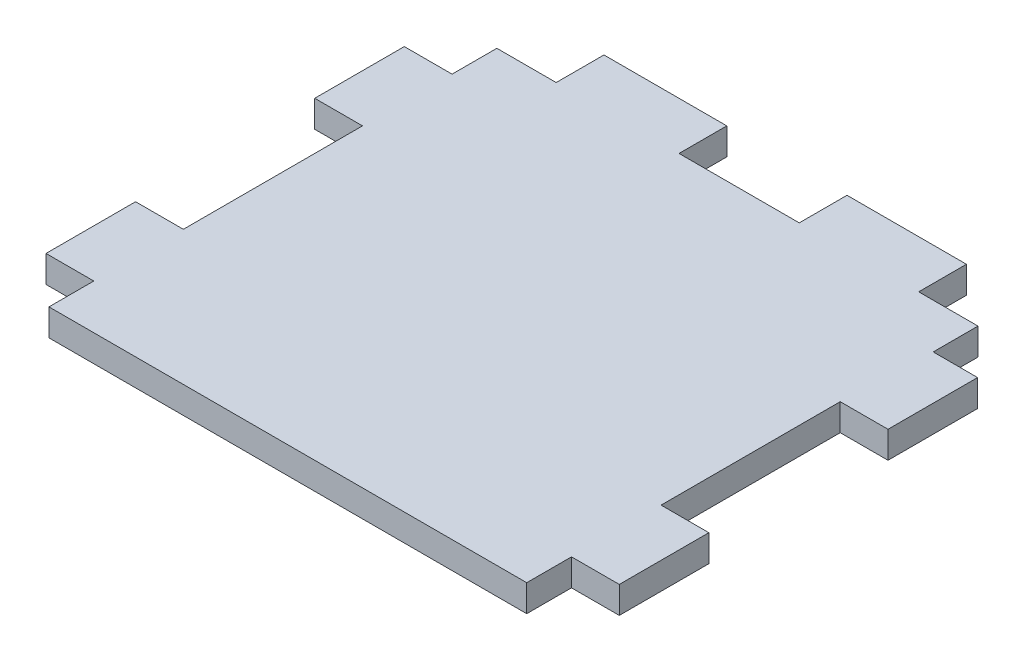
ISO-10303-21;
HEADER;
FILE_DESCRIPTION(('STEP AP214'),'2;1');
FILE_NAME('part.step','',(''),(''),'','','');
FILE_SCHEMA(('AUTOMOTIVE_DESIGN { 1 0 10303 214 1 1 1 1 }'));
ENDSEC;
DATA;
#1=APPLICATION_CONTEXT('core data for automotive mechanical design processes');
#2=APPLICATION_PROTOCOL_DEFINITION('international standard','automotive_design',2000,#1);
#3=PRODUCT_CONTEXT('',#1,'mechanical');
#4=PRODUCT('Part','Part','',(#3));
#5=PRODUCT_RELATED_PRODUCT_CATEGORY('part','',(#4));
#6=PRODUCT_DEFINITION_FORMATION('','',#4);
#7=PRODUCT_DEFINITION_CONTEXT('part definition',#1,'design');
#8=PRODUCT_DEFINITION('design','',#6,#7);
#9=PRODUCT_DEFINITION_SHAPE('','',#8);
#10=(LENGTH_UNIT() NAMED_UNIT(*) SI_UNIT(.MILLI.,.METRE.));
#11=(NAMED_UNIT(*) PLANE_ANGLE_UNIT() SI_UNIT($,.RADIAN.));
#12=(NAMED_UNIT(*) SI_UNIT($,.STERADIAN.) SOLID_ANGLE_UNIT());
#13=UNCERTAINTY_MEASURE_WITH_UNIT(LENGTH_MEASURE(1.E-05),#10,'distance_accuracy_value','');
#14=(GEOMETRIC_REPRESENTATION_CONTEXT(3) GLOBAL_UNCERTAINTY_ASSIGNED_CONTEXT((#13)) GLOBAL_UNIT_ASSIGNED_CONTEXT((#10,
#11,#12)) REPRESENTATION_CONTEXT('',''));
#15=CARTESIAN_POINT('',(0.,0.,0.));
#16=DIRECTION('',(0.,0.,1.));
#17=DIRECTION('',(1.,0.,0.));
#18=AXIS2_PLACEMENT_3D('',#15,#16,#17);
#19=CARTESIAN_POINT('',(40.,-4.5,0.));
#20=DIRECTION('',(-1.,0.,0.));
#21=DIRECTION('',(0.,0.,1.));
#22=AXIS2_PLACEMENT_3D('',#19,#20,#21);
#23=PLANE('',#22);
#24=DIRECTION('',(0.,0.,1.));
#25=VECTOR('',#24,1.);
#26=CARTESIAN_POINT('',(40.,0.,0.));
#27=LINE('',#26,#25);
#28=CARTESIAN_POINT('',(40.,0.,30.));
#29=VERTEX_POINT('',#28);
#30=CARTESIAN_POINT('',(40.,0.,37.5));
#31=VERTEX_POINT('',#30);
#32=EDGE_CURVE('E252',#29,#31,#27,.T.);
#33=ORIENTED_EDGE('',*,*,#32,.T.);
#34=DIRECTION('',(0.,1.,0.));
#35=VECTOR('',#34,1.);
#36=CARTESIAN_POINT('',(40.,-4.5,37.5));
#37=LINE('',#36,#35);
#38=CARTESIAN_POINT('',(40.,-4.5,37.5));
#39=VERTEX_POINT('',#38);
#40=EDGE_CURVE('E11',#39,#31,#37,.T.);
#41=ORIENTED_EDGE('',*,*,#40,.F.);
#42=DIRECTION('',(0.,0.,1.));
#43=VECTOR('',#42,1.);
#44=CARTESIAN_POINT('',(40.,-4.5,0.));
#45=LINE('',#44,#43);
#46=CARTESIAN_POINT('',(40.,-4.5,30.));
#47=VERTEX_POINT('',#46);
#48=EDGE_CURVE('E53',#47,#39,#45,.T.);
#49=ORIENTED_EDGE('',*,*,#48,.F.);
#50=DIRECTION('',(0.,1.,0.));
#51=VECTOR('',#50,1.);
#52=CARTESIAN_POINT('',(40.,-4.5,30.));
#53=LINE('',#52,#51);
#54=EDGE_CURVE('E38',#47,#29,#53,.T.);
#55=ORIENTED_EDGE('',*,*,#54,.T.);
#56=EDGE_LOOP('',(#33,#41,#49,#55));
#57=FACE_BOUND('',#56,.T.);
#58=ADVANCED_FACE('F35',(#57),#23,.F.);
#59=CARTESIAN_POINT('',(0.,-4.5,37.5));
#60=DIRECTION('',(0.,0.,1.));
#61=DIRECTION('',(1.,0.,0.));
#62=AXIS2_PLACEMENT_3D('',#59,#60,#61);
#63=PLANE('',#62);
#64=DIRECTION('',(1.,0.,0.));
#65=VECTOR('',#64,1.);
#66=CARTESIAN_POINT('',(0.,0.,37.5));
#67=LINE('',#66,#65);
#68=CARTESIAN_POINT('',(-40.,0.,37.5));
#69=VERTEX_POINT('',#68);
#70=EDGE_CURVE('E323',#69,#31,#67,.T.);
#71=ORIENTED_EDGE('',*,*,#70,.F.);
#72=DIRECTION('',(0.,1.,0.));
#73=VECTOR('',#72,1.);
#74=CARTESIAN_POINT('',(-40.,-4.5,37.5));
#75=LINE('',#74,#73);
#76=CARTESIAN_POINT('',(-40.,-4.5,37.5));
#77=VERTEX_POINT('',#76);
#78=EDGE_CURVE('E44',#77,#69,#75,.T.);
#79=ORIENTED_EDGE('',*,*,#78,.F.);
#80=DIRECTION('',(1.,0.,0.));
#81=VECTOR('',#80,1.);
#82=CARTESIAN_POINT('',(0.,-4.5,37.5));
#83=LINE('',#82,#81);
#84=EDGE_CURVE('E242',#77,#39,#83,.T.);
#85=ORIENTED_EDGE('',*,*,#84,.T.);
#86=ORIENTED_EDGE('',*,*,#40,.T.);
#87=EDGE_LOOP('',(#71,#79,#85,#86));
#88=FACE_BOUND('',#87,.T.);
#89=ADVANCED_FACE('F385',(#88),#63,.T.);
#90=CARTESIAN_POINT('',(-40.,-4.5,0.));
#91=DIRECTION('',(-1.,0.,0.));
#92=DIRECTION('',(0.,0.,1.));
#93=AXIS2_PLACEMENT_3D('',#90,#91,#92);
#94=PLANE('',#93);
#95=DIRECTION('',(0.,0.,1.));
#96=VECTOR('',#95,1.);
#97=CARTESIAN_POINT('',(-40.,0.,0.));
#98=LINE('',#97,#96);
#99=CARTESIAN_POINT('',(-40.,0.,30.));
#100=VERTEX_POINT('',#99);
#101=EDGE_CURVE('E230',#100,#69,#98,.T.);
#102=ORIENTED_EDGE('',*,*,#101,.F.);
#103=DIRECTION('',(0.,1.,0.));
#104=VECTOR('',#103,1.);
#105=CARTESIAN_POINT('',(-40.,-4.5,30.));
#106=LINE('',#105,#104);
#107=CARTESIAN_POINT('',(-40.,-4.5,30.));
#108=VERTEX_POINT('',#107);
#109=EDGE_CURVE('E226',#108,#100,#106,.T.);
#110=ORIENTED_EDGE('',*,*,#109,.F.);
#111=DIRECTION('',(0.,0.,1.));
#112=VECTOR('',#111,1.);
#113=CARTESIAN_POINT('',(-40.,-4.5,0.));
#114=LINE('',#113,#112);
#115=EDGE_CURVE('E229',#108,#77,#114,.T.);
#116=ORIENTED_EDGE('',*,*,#115,.T.);
#117=ORIENTED_EDGE('',*,*,#78,.T.);
#118=EDGE_LOOP('',(#102,#110,#116,#117));
#119=FACE_BOUND('',#118,.T.);
#120=ADVANCED_FACE('F228',(#119),#94,.T.);
#121=CARTESIAN_POINT('',(0.,-4.5,30.));
#122=DIRECTION('',(0.,0.,1.));
#123=DIRECTION('',(1.,0.,0.));
#124=AXIS2_PLACEMENT_3D('',#121,#122,#123);
#125=PLANE('',#124);
#126=DIRECTION('',(1.,0.,0.));
#127=VECTOR('',#126,1.);
#128=CARTESIAN_POINT('',(0.,0.,30.));
#129=LINE('',#128,#127);
#130=CARTESIAN_POINT('',(-48.,0.,30.));
#131=VERTEX_POINT('',#130);
#132=EDGE_CURVE('E320',#131,#100,#129,.T.);
#133=ORIENTED_EDGE('',*,*,#132,.F.);
#134=DIRECTION('',(0.,1.,0.));
#135=VECTOR('',#134,1.);
#136=CARTESIAN_POINT('',(-48.,-4.5,30.));
#137=LINE('',#136,#135);
#138=CARTESIAN_POINT('',(-48.,-4.5,30.));
#139=VERTEX_POINT('',#138);
#140=EDGE_CURVE('E235',#139,#131,#137,.T.);
#141=ORIENTED_EDGE('',*,*,#140,.F.);
#142=DIRECTION('',(1.,0.,0.));
#143=VECTOR('',#142,1.);
#144=CARTESIAN_POINT('',(0.,-4.5,30.));
#145=LINE('',#144,#143);
#146=EDGE_CURVE('E240',#139,#108,#145,.T.);
#147=ORIENTED_EDGE('',*,*,#146,.T.);
#148=ORIENTED_EDGE('',*,*,#109,.T.);
#149=EDGE_LOOP('',(#133,#141,#147,#148));
#150=FACE_BOUND('',#149,.T.);
#151=ADVANCED_FACE('F244',(#150),#125,.T.);
#152=CARTESIAN_POINT('',(-48.,-4.5,0.));
#153=DIRECTION('',(-1.,0.,0.));
#154=DIRECTION('',(0.,0.,1.));
#155=AXIS2_PLACEMENT_3D('',#152,#153,#154);
#156=PLANE('',#155);
#157=DIRECTION('',(0.,0.,1.));
#158=VECTOR('',#157,1.);
#159=CARTESIAN_POINT('',(-48.,0.,0.));
#160=LINE('',#159,#158);
#161=CARTESIAN_POINT('',(-48.,0.,15.));
#162=VERTEX_POINT('',#161);
#163=EDGE_CURVE('E317',#162,#131,#160,.T.);
#164=ORIENTED_EDGE('',*,*,#163,.F.);
#165=DIRECTION('',(0.,1.,0.));
#166=VECTOR('',#165,1.);
#167=CARTESIAN_POINT('',(-48.,-4.5,15.));
#168=LINE('',#167,#166);
#169=CARTESIAN_POINT('',(-48.,-4.5,15.));
#170=VERTEX_POINT('',#169);
#171=EDGE_CURVE('E328',#170,#162,#168,.T.);
#172=ORIENTED_EDGE('',*,*,#171,.F.);
#173=DIRECTION('',(0.,0.,1.));
#174=VECTOR('',#173,1.);
#175=CARTESIAN_POINT('',(-48.,-4.5,0.));
#176=LINE('',#175,#174);
#177=EDGE_CURVE('E245',#170,#139,#176,.T.);
#178=ORIENTED_EDGE('',*,*,#177,.T.);
#179=ORIENTED_EDGE('',*,*,#140,.T.);
#180=EDGE_LOOP('',(#164,#172,#178,#179));
#181=FACE_BOUND('',#180,.T.);
#182=ADVANCED_FACE('F398',(#181),#156,.T.);
#183=CARTESIAN_POINT('',(0.,-4.5,15.));
#184=DIRECTION('',(0.,0.,-1.));
#185=DIRECTION('',(-1.,0.,0.));
#186=AXIS2_PLACEMENT_3D('',#183,#184,#185);
#187=PLANE('',#186);
#188=DIRECTION('',(-1.,0.,0.));
#189=VECTOR('',#188,1.);
#190=CARTESIAN_POINT('',(0.,0.,15.));
#191=LINE('',#190,#189);
#192=CARTESIAN_POINT('',(-40.,0.,15.));
#193=VERTEX_POINT('',#192);
#194=EDGE_CURVE('E314',#193,#162,#191,.T.);
#195=ORIENTED_EDGE('',*,*,#194,.F.);
#196=DIRECTION('',(0.,1.,0.));
#197=VECTOR('',#196,1.);
#198=CARTESIAN_POINT('',(-40.,-4.5,15.));
#199=LINE('',#198,#197);
#200=CARTESIAN_POINT('',(-40.,-4.5,15.));
#201=VERTEX_POINT('',#200);
#202=EDGE_CURVE('E330',#201,#193,#199,.T.);
#203=ORIENTED_EDGE('',*,*,#202,.F.);
#204=DIRECTION('',(-1.,0.,0.));
#205=VECTOR('',#204,1.);
#206=CARTESIAN_POINT('',(0.,-4.5,15.));
#207=LINE('',#206,#205);
#208=EDGE_CURVE('E247',#201,#170,#207,.T.);
#209=ORIENTED_EDGE('',*,*,#208,.T.);
#210=ORIENTED_EDGE('',*,*,#171,.T.);
#211=EDGE_LOOP('',(#195,#203,#209,#210));
#212=FACE_BOUND('',#211,.T.);
#213=ADVANCED_FACE('F401',(#212),#187,.T.);
#214=CARTESIAN_POINT('',(-40.0000000000001,-4.5,0.));
#215=DIRECTION('',(1.,0.,0.));
#216=DIRECTION('',(0.,0.,-1.));
#217=AXIS2_PLACEMENT_3D('',#214,#215,#216);
#218=PLANE('',#217);
#219=DIRECTION('',(0.,0.,-1.));
#220=VECTOR('',#219,1.);
#221=CARTESIAN_POINT('',(-40.0000000000001,0.,0.));
#222=LINE('',#221,#220);
#223=CARTESIAN_POINT('',(-40.0000000000001,0.,-15.));
#224=VERTEX_POINT('',#223);
#225=EDGE_CURVE('E312',#193,#224,#222,.T.);
#226=ORIENTED_EDGE('',*,*,#225,.T.);
#227=DIRECTION('',(0.,1.,0.));
#228=VECTOR('',#227,1.);
#229=CARTESIAN_POINT('',(-40.0000000000001,-4.5,-15.));
#230=LINE('',#229,#228);
#231=CARTESIAN_POINT('',(-40.0000000000001,-4.5,-15.));
#232=VERTEX_POINT('',#231);
#233=EDGE_CURVE('E332',#232,#224,#230,.T.);
#234=ORIENTED_EDGE('',*,*,#233,.F.);
#235=DIRECTION('',(0.,0.,-1.));
#236=VECTOR('',#235,1.);
#237=CARTESIAN_POINT('',(-40.0000000000001,-4.5,0.));
#238=LINE('',#237,#236);
#239=EDGE_CURVE('E771',#201,#232,#238,.T.);
#240=ORIENTED_EDGE('',*,*,#239,.F.);
#241=ORIENTED_EDGE('',*,*,#202,.T.);
#242=EDGE_LOOP('',(#226,#234,#240,#241));
#243=FACE_BOUND('',#242,.T.);
#244=ADVANCED_FACE('F405',(#243),#218,.F.);
#245=CARTESIAN_POINT('',(0.,-4.5,-15.));
#246=DIRECTION('',(0.,0.,-1.));
#247=DIRECTION('',(-1.,0.,0.));
#248=AXIS2_PLACEMENT_3D('',#245,#246,#247);
#249=PLANE('',#248);
#250=DIRECTION('',(-1.,0.,0.));
#251=VECTOR('',#250,1.);
#252=CARTESIAN_POINT('',(0.,0.,-15.));
#253=LINE('',#252,#251);
#254=CARTESIAN_POINT('',(-48.,0.,-15.));
#255=VERTEX_POINT('',#254);
#256=EDGE_CURVE('E310',#224,#255,#253,.T.);
#257=ORIENTED_EDGE('',*,*,#256,.T.);
#258=DIRECTION('',(0.,1.,0.));
#259=VECTOR('',#258,1.);
#260=CARTESIAN_POINT('',(-48.,-4.5,-15.));
#261=LINE('',#260,#259);
#262=CARTESIAN_POINT('',(-48.,-4.5,-15.));
#263=VERTEX_POINT('',#262);
#264=EDGE_CURVE('E335',#263,#255,#261,.T.);
#265=ORIENTED_EDGE('',*,*,#264,.F.);
#266=DIRECTION('',(-1.,0.,0.));
#267=VECTOR('',#266,1.);
#268=CARTESIAN_POINT('',(0.,-4.5,-15.));
#269=LINE('',#268,#267);
#270=EDGE_CURVE('E768',#232,#263,#269,.T.);
#271=ORIENTED_EDGE('',*,*,#270,.F.);
#272=ORIENTED_EDGE('',*,*,#233,.T.);
#273=EDGE_LOOP('',(#257,#265,#271,#272));
#274=FACE_BOUND('',#273,.T.);
#275=ADVANCED_FACE('F409',(#274),#249,.F.);
#276=CARTESIAN_POINT('',(-48.,-4.5,0.));
#277=DIRECTION('',(1.,0.,0.));
#278=DIRECTION('',(0.,0.,-1.));
#279=AXIS2_PLACEMENT_3D('',#276,#277,#278);
#280=PLANE('',#279);
#281=DIRECTION('',(0.,0.,-1.));
#282=VECTOR('',#281,1.);
#283=CARTESIAN_POINT('',(-48.,0.,0.));
#284=LINE('',#283,#282);
#285=CARTESIAN_POINT('',(-48.,0.,-30.));
#286=VERTEX_POINT('',#285);
#287=EDGE_CURVE('E307',#255,#286,#284,.T.);
#288=ORIENTED_EDGE('',*,*,#287,.T.);
#289=DIRECTION('',(0.,1.,0.));
#290=VECTOR('',#289,1.);
#291=CARTESIAN_POINT('',(-48.,-4.5,-30.));
#292=LINE('',#291,#290);
#293=CARTESIAN_POINT('',(-48.,-4.5,-30.));
#294=VERTEX_POINT('',#293);
#295=EDGE_CURVE('E338',#294,#286,#292,.T.);
#296=ORIENTED_EDGE('',*,*,#295,.F.);
#297=DIRECTION('',(0.,0.,-1.));
#298=VECTOR('',#297,1.);
#299=CARTESIAN_POINT('',(-48.,-4.5,0.));
#300=LINE('',#299,#298);
#301=EDGE_CURVE('E766',#263,#294,#300,.T.);
#302=ORIENTED_EDGE('',*,*,#301,.F.);
#303=ORIENTED_EDGE('',*,*,#264,.T.);
#304=EDGE_LOOP('',(#288,#296,#302,#303));
#305=FACE_BOUND('',#304,.T.);
#306=ADVANCED_FACE('F413',(#305),#280,.F.);
#307=CARTESIAN_POINT('',(0.,-4.5,-30.));
#308=DIRECTION('',(0.,0.,-1.));
#309=DIRECTION('',(-1.,0.,0.));
#310=AXIS2_PLACEMENT_3D('',#307,#308,#309);
#311=PLANE('',#310);
#312=DIRECTION('',(-1.,0.,0.));
#313=VECTOR('',#312,1.);
#314=CARTESIAN_POINT('',(0.,0.,-30.));
#315=LINE('',#314,#313);
#316=CARTESIAN_POINT('',(-40.,0.,-30.));
#317=VERTEX_POINT('',#316);
#318=EDGE_CURVE('E304',#317,#286,#315,.T.);
#319=ORIENTED_EDGE('',*,*,#318,.F.);
#320=DIRECTION('',(0.,1.,0.));
#321=VECTOR('',#320,1.);
#322=CARTESIAN_POINT('',(-40.,-4.5,-30.));
#323=LINE('',#322,#321);
#324=CARTESIAN_POINT('',(-40.,-4.5,-30.));
#325=VERTEX_POINT('',#324);
#326=EDGE_CURVE('E340',#325,#317,#323,.T.);
#327=ORIENTED_EDGE('',*,*,#326,.F.);
#328=DIRECTION('',(-1.,0.,0.));
#329=VECTOR('',#328,1.);
#330=CARTESIAN_POINT('',(0.,-4.5,-30.));
#331=LINE('',#330,#329);
#332=EDGE_CURVE('E780',#325,#294,#331,.T.);
#333=ORIENTED_EDGE('',*,*,#332,.T.);
#334=ORIENTED_EDGE('',*,*,#295,.T.);
#335=EDGE_LOOP('',(#319,#327,#333,#334));
#336=FACE_BOUND('',#335,.T.);
#337=ADVANCED_FACE('F417',(#336),#311,.T.);
#338=CARTESIAN_POINT('',(-40.,-4.5,0.));
#339=DIRECTION('',(-1.,0.,0.));
#340=DIRECTION('',(0.,0.,1.));
#341=AXIS2_PLACEMENT_3D('',#338,#339,#340);
#342=PLANE('',#341);
#343=DIRECTION('',(0.,0.,1.));
#344=VECTOR('',#343,1.);
#345=CARTESIAN_POINT('',(-40.,0.,0.));
#346=LINE('',#345,#344);
#347=CARTESIAN_POINT('',(-40.,0.,-37.5));
#348=VERTEX_POINT('',#347);
#349=EDGE_CURVE('E301',#348,#317,#346,.T.);
#350=ORIENTED_EDGE('',*,*,#349,.F.);
#351=DIRECTION('',(0.,1.,0.));
#352=VECTOR('',#351,1.);
#353=CARTESIAN_POINT('',(-40.,-4.5,-37.5));
#354=LINE('',#353,#352);
#355=CARTESIAN_POINT('',(-40.,-4.5,-37.5));
#356=VERTEX_POINT('',#355);
#357=EDGE_CURVE('E342',#356,#348,#354,.T.);
#358=ORIENTED_EDGE('',*,*,#357,.F.);
#359=DIRECTION('',(0.,0.,1.));
#360=VECTOR('',#359,1.);
#361=CARTESIAN_POINT('',(-40.,-4.5,0.));
#362=LINE('',#361,#360);
#363=EDGE_CURVE('E757',#356,#325,#362,.T.);
#364=ORIENTED_EDGE('',*,*,#363,.T.);
#365=ORIENTED_EDGE('',*,*,#326,.T.);
#366=EDGE_LOOP('',(#350,#358,#364,#365));
#367=FACE_BOUND('',#366,.T.);
#368=ADVANCED_FACE('F421',(#367),#342,.T.);
#369=CARTESIAN_POINT('',(0.,-4.5,-37.5));
#370=DIRECTION('',(0.,0.,1.));
#371=DIRECTION('',(1.,0.,0.));
#372=AXIS2_PLACEMENT_3D('',#369,#370,#371);
#373=PLANE('',#372);
#374=DIRECTION('',(1.,0.,0.));
#375=VECTOR('',#374,1.);
#376=CARTESIAN_POINT('',(0.,0.,-37.5));
#377=LINE('',#376,#375);
#378=CARTESIAN_POINT('',(-30.066262520942,0.,-37.5));
#379=VERTEX_POINT('',#378);
#380=EDGE_CURVE('E298',#348,#379,#377,.T.);
#381=ORIENTED_EDGE('',*,*,#380,.T.);
#382=DIRECTION('',(0.,1.,0.));
#383=VECTOR('',#382,1.);
#384=CARTESIAN_POINT('',(-30.066262520942,-4.5,-37.5));
#385=LINE('',#384,#383);
#386=CARTESIAN_POINT('',(-30.066262520942,-4.5,-37.5));
#387=VERTEX_POINT('',#386);
#388=EDGE_CURVE('E344',#387,#379,#385,.T.);
#389=ORIENTED_EDGE('',*,*,#388,.F.);
#390=DIRECTION('',(1.,0.,0.));
#391=VECTOR('',#390,1.);
#392=CARTESIAN_POINT('',(0.,-4.5,-37.5));
#393=LINE('',#392,#391);
#394=EDGE_CURVE('E783',#356,#387,#393,.T.);
#395=ORIENTED_EDGE('',*,*,#394,.F.);
#396=ORIENTED_EDGE('',*,*,#357,.T.);
#397=EDGE_LOOP('',(#381,#389,#395,#396));
#398=FACE_BOUND('',#397,.T.);
#399=ADVANCED_FACE('F425',(#398),#373,.F.);
#400=CARTESIAN_POINT('',(-30.066262520942,-4.5,0.));
#401=DIRECTION('',(-1.,0.,0.));
#402=DIRECTION('',(0.,0.,1.));
#403=AXIS2_PLACEMENT_3D('',#400,#401,#402);
#404=PLANE('',#403);
#405=DIRECTION('',(0.,0.,1.));
#406=VECTOR('',#405,1.);
#407=CARTESIAN_POINT('',(-30.066262520942,0.,0.));
#408=LINE('',#407,#406);
#409=CARTESIAN_POINT('',(-30.066262520942,0.,-45.5));
#410=VERTEX_POINT('',#409);
#411=EDGE_CURVE('E295',#410,#379,#408,.T.);
#412=ORIENTED_EDGE('',*,*,#411,.F.);
#413=DIRECTION('',(0.,1.,0.));
#414=VECTOR('',#413,1.);
#415=CARTESIAN_POINT('',(-30.066262520942,-4.5,-45.5));
#416=LINE('',#415,#414);
#417=CARTESIAN_POINT('',(-30.066262520942,-4.5,-45.5));
#418=VERTEX_POINT('',#417);
#419=EDGE_CURVE('E346',#418,#410,#416,.T.);
#420=ORIENTED_EDGE('',*,*,#419,.F.);
#421=DIRECTION('',(0.,0.,1.));
#422=VECTOR('',#421,1.);
#423=CARTESIAN_POINT('',(-30.066262520942,-4.5,0.));
#424=LINE('',#423,#422);
#425=EDGE_CURVE('E751',#418,#387,#424,.T.);
#426=ORIENTED_EDGE('',*,*,#425,.T.);
#427=ORIENTED_EDGE('',*,*,#388,.T.);
#428=EDGE_LOOP('',(#412,#420,#426,#427));
#429=FACE_BOUND('',#428,.T.);
#430=ADVANCED_FACE('F429',(#429),#404,.T.);
#431=CARTESIAN_POINT('',(0.,-4.5,-45.5));
#432=DIRECTION('',(0.,0.,1.));
#433=DIRECTION('',(1.,0.,0.));
#434=AXIS2_PLACEMENT_3D('',#431,#432,#433);
#435=PLANE('',#434);
#436=DIRECTION('',(1.,0.,0.));
#437=VECTOR('',#436,1.);
#438=CARTESIAN_POINT('',(0.,0.,-45.5));
#439=LINE('',#438,#437);
#440=CARTESIAN_POINT('',(-9.49626252094199,0.,-45.5));
#441=VERTEX_POINT('',#440);
#442=EDGE_CURVE('E293',#410,#441,#439,.T.);
#443=ORIENTED_EDGE('',*,*,#442,.T.);
#444=DIRECTION('',(0.,1.,0.));
#445=VECTOR('',#444,1.);
#446=CARTESIAN_POINT('',(-9.49626252094199,-4.5,-45.5));
#447=LINE('',#446,#445);
#448=CARTESIAN_POINT('',(-9.49626252094199,-4.5,-45.5));
#449=VERTEX_POINT('',#448);
#450=EDGE_CURVE('E348',#449,#441,#447,.T.);
#451=ORIENTED_EDGE('',*,*,#450,.F.);
#452=DIRECTION('',(1.,0.,0.));
#453=VECTOR('',#452,1.);
#454=CARTESIAN_POINT('',(0.,-4.5,-45.5));
#455=LINE('',#454,#453);
#456=EDGE_CURVE('E786',#418,#449,#455,.T.);
#457=ORIENTED_EDGE('',*,*,#456,.F.);
#458=ORIENTED_EDGE('',*,*,#419,.T.);
#459=EDGE_LOOP('',(#443,#451,#457,#458));
#460=FACE_BOUND('',#459,.T.);
#461=ADVANCED_FACE('F433',(#460),#435,.F.);
#462=CARTESIAN_POINT('',(-9.49626252094199,-4.5,0.));
#463=DIRECTION('',(-1.,0.,0.));
#464=DIRECTION('',(0.,0.,1.));
#465=AXIS2_PLACEMENT_3D('',#462,#463,#464);
#466=PLANE('',#465);
#467=DIRECTION('',(0.,0.,1.));
#468=VECTOR('',#467,1.);
#469=CARTESIAN_POINT('',(-9.49626252094199,0.,0.));
#470=LINE('',#469,#468);
#471=CARTESIAN_POINT('',(-9.49626252094199,0.,-37.5));
#472=VERTEX_POINT('',#471);
#473=EDGE_CURVE('E291',#441,#472,#470,.T.);
#474=ORIENTED_EDGE('',*,*,#473,.T.);
#475=DIRECTION('',(0.,1.,0.));
#476=VECTOR('',#475,1.);
#477=CARTESIAN_POINT('',(-9.49626252094199,-4.5,-37.5));
#478=LINE('',#477,#476);
#479=CARTESIAN_POINT('',(-9.49626252094199,-4.5,-37.5));
#480=VERTEX_POINT('',#479);
#481=EDGE_CURVE('E351',#480,#472,#478,.T.);
#482=ORIENTED_EDGE('',*,*,#481,.F.);
#483=DIRECTION('',(0.,0.,1.));
#484=VECTOR('',#483,1.);
#485=CARTESIAN_POINT('',(-9.49626252094199,-4.5,0.));
#486=LINE('',#485,#484);
#487=EDGE_CURVE('E742',#449,#480,#486,.T.);
#488=ORIENTED_EDGE('',*,*,#487,.F.);
#489=ORIENTED_EDGE('',*,*,#450,.T.);
#490=EDGE_LOOP('',(#474,#482,#488,#489));
#491=FACE_BOUND('',#490,.T.);
#492=ADVANCED_FACE('F437',(#491),#466,.F.);
#493=CARTESIAN_POINT('',(0.,-4.5,-37.5));
#494=DIRECTION('',(0.,0.,1.));
#495=DIRECTION('',(1.,0.,0.));
#496=AXIS2_PLACEMENT_3D('',#493,#494,#495);
#497=PLANE('',#496);
#498=DIRECTION('',(1.,0.,0.));
#499=VECTOR('',#498,1.);
#500=CARTESIAN_POINT('',(0.,0.,-37.5));
#501=LINE('',#500,#499);
#502=CARTESIAN_POINT('',(10.636262520942,0.,-37.5));
#503=VERTEX_POINT('',#502);
#504=EDGE_CURVE('E288',#472,#503,#501,.T.);
#505=ORIENTED_EDGE('',*,*,#504,.T.);
#506=DIRECTION('',(0.,1.,0.));
#507=VECTOR('',#506,1.);
#508=CARTESIAN_POINT('',(10.636262520942,-4.5,-37.5));
#509=LINE('',#508,#507);
#510=CARTESIAN_POINT('',(10.636262520942,-4.5,-37.5));
#511=VERTEX_POINT('',#510);
#512=EDGE_CURVE('E354',#511,#503,#509,.T.);
#513=ORIENTED_EDGE('',*,*,#512,.F.);
#514=DIRECTION('',(1.,0.,0.));
#515=VECTOR('',#514,1.);
#516=CARTESIAN_POINT('',(0.,-4.5,-37.5));
#517=LINE('',#516,#515);
#518=EDGE_CURVE('E740',#480,#511,#517,.T.);
#519=ORIENTED_EDGE('',*,*,#518,.F.);
#520=ORIENTED_EDGE('',*,*,#481,.T.);
#521=EDGE_LOOP('',(#505,#513,#519,#520));
#522=FACE_BOUND('',#521,.T.);
#523=ADVANCED_FACE('F441',(#522),#497,.F.);
#524=CARTESIAN_POINT('',(10.636262520942,-4.5,0.));
#525=DIRECTION('',(-1.,0.,0.));
#526=DIRECTION('',(0.,0.,1.));
#527=AXIS2_PLACEMENT_3D('',#524,#525,#526);
#528=PLANE('',#527);
#529=DIRECTION('',(0.,0.,1.));
#530=VECTOR('',#529,1.);
#531=CARTESIAN_POINT('',(10.636262520942,0.,0.));
#532=LINE('',#531,#530);
#533=CARTESIAN_POINT('',(10.636262520942,0.,-45.5));
#534=VERTEX_POINT('',#533);
#535=EDGE_CURVE('E285',#534,#503,#532,.T.);
#536=ORIENTED_EDGE('',*,*,#535,.F.);
#537=DIRECTION('',(0.,1.,0.));
#538=VECTOR('',#537,1.);
#539=CARTESIAN_POINT('',(10.636262520942,-4.5,-45.5));
#540=LINE('',#539,#538);
#541=CARTESIAN_POINT('',(10.636262520942,-4.5,-45.5));
#542=VERTEX_POINT('',#541);
#543=EDGE_CURVE('E356',#542,#534,#540,.T.);
#544=ORIENTED_EDGE('',*,*,#543,.F.);
#545=DIRECTION('',(0.,0.,1.));
#546=VECTOR('',#545,1.);
#547=CARTESIAN_POINT('',(10.636262520942,-4.5,0.));
#548=LINE('',#547,#546);
#549=EDGE_CURVE('E737',#542,#511,#548,.T.);
#550=ORIENTED_EDGE('',*,*,#549,.T.);
#551=ORIENTED_EDGE('',*,*,#512,.T.);
#552=EDGE_LOOP('',(#536,#544,#550,#551));
#553=FACE_BOUND('',#552,.T.);
#554=ADVANCED_FACE('F445',(#553),#528,.T.);
#555=CARTESIAN_POINT('',(0.,-4.5,-45.5));
#556=DIRECTION('',(0.,0.,-1.));
#557=DIRECTION('',(-1.,0.,0.));
#558=AXIS2_PLACEMENT_3D('',#555,#556,#557);
#559=PLANE('',#558);
#560=DIRECTION('',(-1.,0.,0.));
#561=VECTOR('',#560,1.);
#562=CARTESIAN_POINT('',(0.,0.,-45.5));
#563=LINE('',#562,#561);
#564=CARTESIAN_POINT('',(30.636262520942,0.,-45.5));
#565=VERTEX_POINT('',#564);
#566=EDGE_CURVE('E282',#565,#534,#563,.T.);
#567=ORIENTED_EDGE('',*,*,#566,.F.);
#568=DIRECTION('',(0.,1.,0.));
#569=VECTOR('',#568,1.);
#570=CARTESIAN_POINT('',(30.636262520942,-4.5,-45.5));
#571=LINE('',#570,#569);
#572=CARTESIAN_POINT('',(30.636262520942,-4.5,-45.5));
#573=VERTEX_POINT('',#572);
#574=EDGE_CURVE('E358',#573,#565,#571,.T.);
#575=ORIENTED_EDGE('',*,*,#574,.F.);
#576=DIRECTION('',(-1.,0.,0.));
#577=VECTOR('',#576,1.);
#578=CARTESIAN_POINT('',(0.,-4.5,-45.5));
#579=LINE('',#578,#577);
#580=EDGE_CURVE('E730',#573,#542,#579,.T.);
#581=ORIENTED_EDGE('',*,*,#580,.T.);
#582=ORIENTED_EDGE('',*,*,#543,.T.);
#583=EDGE_LOOP('',(#567,#575,#581,#582));
#584=FACE_BOUND('',#583,.T.);
#585=ADVANCED_FACE('F449',(#584),#559,.T.);
#586=CARTESIAN_POINT('',(30.636262520942,-4.5,0.));
#587=DIRECTION('',(-1.,0.,0.));
#588=DIRECTION('',(0.,0.,1.));
#589=AXIS2_PLACEMENT_3D('',#586,#587,#588);
#590=PLANE('',#589);
#591=DIRECTION('',(0.,0.,1.));
#592=VECTOR('',#591,1.);
#593=CARTESIAN_POINT('',(30.636262520942,0.,0.));
#594=LINE('',#593,#592);
#595=CARTESIAN_POINT('',(30.636262520942,0.,-37.5));
#596=VERTEX_POINT('',#595);
#597=EDGE_CURVE('E279',#565,#596,#594,.T.);
#598=ORIENTED_EDGE('',*,*,#597,.T.);
#599=DIRECTION('',(0.,1.,0.));
#600=VECTOR('',#599,1.);
#601=CARTESIAN_POINT('',(30.636262520942,-4.5,-37.5));
#602=LINE('',#601,#600);
#603=CARTESIAN_POINT('',(30.636262520942,-4.5,-37.5));
#604=VERTEX_POINT('',#603);
#605=EDGE_CURVE('E360',#604,#596,#602,.T.);
#606=ORIENTED_EDGE('',*,*,#605,.F.);
#607=DIRECTION('',(0.,0.,1.));
#608=VECTOR('',#607,1.);
#609=CARTESIAN_POINT('',(30.636262520942,-4.5,0.));
#610=LINE('',#609,#608);
#611=EDGE_CURVE('E727',#573,#604,#610,.T.);
#612=ORIENTED_EDGE('',*,*,#611,.F.);
#613=ORIENTED_EDGE('',*,*,#574,.T.);
#614=EDGE_LOOP('',(#598,#606,#612,#613));
#615=FACE_BOUND('',#614,.T.);
#616=ADVANCED_FACE('F453',(#615),#590,.F.);
#617=CARTESIAN_POINT('',(0.,-4.5,-37.5));
#618=DIRECTION('',(0.,0.,-1.));
#619=DIRECTION('',(-1.,0.,0.));
#620=AXIS2_PLACEMENT_3D('',#617,#618,#619);
#621=PLANE('',#620);
#622=DIRECTION('',(-1.,0.,0.));
#623=VECTOR('',#622,1.);
#624=CARTESIAN_POINT('',(0.,0.,-37.5));
#625=LINE('',#624,#623);
#626=CARTESIAN_POINT('',(40.57,0.,-37.5));
#627=VERTEX_POINT('',#626);
#628=EDGE_CURVE('E276',#627,#596,#625,.T.);
#629=ORIENTED_EDGE('',*,*,#628,.F.);
#630=DIRECTION('',(0.,1.,0.));
#631=VECTOR('',#630,1.);
#632=CARTESIAN_POINT('',(40.57,-4.5,-37.5));
#633=LINE('',#632,#631);
#634=CARTESIAN_POINT('',(40.57,-4.5,-37.5));
#635=VERTEX_POINT('',#634);
#636=EDGE_CURVE('E362',#635,#627,#633,.T.);
#637=ORIENTED_EDGE('',*,*,#636,.F.);
#638=DIRECTION('',(-1.,0.,0.));
#639=VECTOR('',#638,1.);
#640=CARTESIAN_POINT('',(0.,-4.5,-37.5));
#641=LINE('',#640,#639);
#642=EDGE_CURVE('E725',#635,#604,#641,.T.);
#643=ORIENTED_EDGE('',*,*,#642,.T.);
#644=ORIENTED_EDGE('',*,*,#605,.T.);
#645=EDGE_LOOP('',(#629,#637,#643,#644));
#646=FACE_BOUND('',#645,.T.);
#647=ADVANCED_FACE('F457',(#646),#621,.T.);
#648=CARTESIAN_POINT('',(40.57,-4.5,0.));
#649=DIRECTION('',(1.,0.,0.));
#650=DIRECTION('',(0.,0.,-1.));
#651=AXIS2_PLACEMENT_3D('',#648,#649,#650);
#652=PLANE('',#651);
#653=DIRECTION('',(0.,0.,-1.));
#654=VECTOR('',#653,1.);
#655=CARTESIAN_POINT('',(40.57,0.,0.));
#656=LINE('',#655,#654);
#657=CARTESIAN_POINT('',(40.57,0.,-30.));
#658=VERTEX_POINT('',#657);
#659=EDGE_CURVE('E273',#658,#627,#656,.T.);
#660=ORIENTED_EDGE('',*,*,#659,.F.);
#661=DIRECTION('',(0.,1.,0.));
#662=VECTOR('',#661,1.);
#663=CARTESIAN_POINT('',(40.57,-4.5,-30.));
#664=LINE('',#663,#662);
#665=CARTESIAN_POINT('',(40.57,-4.5,-30.));
#666=VERTEX_POINT('',#665);
#667=EDGE_CURVE('E364',#666,#658,#664,.T.);
#668=ORIENTED_EDGE('',*,*,#667,.F.);
#669=DIRECTION('',(0.,0.,-1.));
#670=VECTOR('',#669,1.);
#671=CARTESIAN_POINT('',(40.57,-4.5,0.));
#672=LINE('',#671,#670);
#673=EDGE_CURVE('E794',#666,#635,#672,.T.);
#674=ORIENTED_EDGE('',*,*,#673,.T.);
#675=ORIENTED_EDGE('',*,*,#636,.T.);
#676=EDGE_LOOP('',(#660,#668,#674,#675));
#677=FACE_BOUND('',#676,.T.);
#678=ADVANCED_FACE('F461',(#677),#652,.T.);
#679=CARTESIAN_POINT('',(0.,-4.5,-30.));
#680=DIRECTION('',(0.,0.,-1.));
#681=DIRECTION('',(-1.,0.,0.));
#682=AXIS2_PLACEMENT_3D('',#679,#680,#681);
#683=PLANE('',#682);
#684=DIRECTION('',(-1.,0.,0.));
#685=VECTOR('',#684,1.);
#686=CARTESIAN_POINT('',(0.,0.,-30.));
#687=LINE('',#686,#685);
#688=CARTESIAN_POINT('',(48.,0.,-30.));
#689=VERTEX_POINT('',#688);
#690=EDGE_CURVE('E270',#689,#658,#687,.T.);
#691=ORIENTED_EDGE('',*,*,#690,.F.);
#692=DIRECTION('',(0.,1.,0.));
#693=VECTOR('',#692,1.);
#694=CARTESIAN_POINT('',(48.,-4.5,-30.));
#695=LINE('',#694,#693);
#696=CARTESIAN_POINT('',(48.,-4.5,-30.));
#697=VERTEX_POINT('',#696);
#698=EDGE_CURVE('E366',#697,#689,#695,.T.);
#699=ORIENTED_EDGE('',*,*,#698,.F.);
#700=DIRECTION('',(-1.,0.,0.));
#701=VECTOR('',#700,1.);
#702=CARTESIAN_POINT('',(0.,-4.5,-30.));
#703=LINE('',#702,#701);
#704=EDGE_CURVE('E716',#697,#666,#703,.T.);
#705=ORIENTED_EDGE('',*,*,#704,.T.);
#706=ORIENTED_EDGE('',*,*,#667,.T.);
#707=EDGE_LOOP('',(#691,#699,#705,#706));
#708=FACE_BOUND('',#707,.T.);
#709=ADVANCED_FACE('F465',(#708),#683,.T.);
#710=CARTESIAN_POINT('',(48.,-4.5,0.));
#711=DIRECTION('',(1.,0.,0.));
#712=DIRECTION('',(0.,0.,-1.));
#713=AXIS2_PLACEMENT_3D('',#710,#711,#712);
#714=PLANE('',#713);
#715=DIRECTION('',(0.,0.,-1.));
#716=VECTOR('',#715,1.);
#717=CARTESIAN_POINT('',(48.,0.,0.));
#718=LINE('',#717,#716);
#719=CARTESIAN_POINT('',(48.,0.,-15.));
#720=VERTEX_POINT('',#719);
#721=EDGE_CURVE('E267',#720,#689,#718,.T.);
#722=ORIENTED_EDGE('',*,*,#721,.F.);
#723=DIRECTION('',(0.,1.,0.));
#724=VECTOR('',#723,1.);
#725=CARTESIAN_POINT('',(48.,-4.5,-15.));
#726=LINE('',#725,#724);
#727=CARTESIAN_POINT('',(48.,-4.5,-15.));
#728=VERTEX_POINT('',#727);
#729=EDGE_CURVE('E368',#728,#720,#726,.T.);
#730=ORIENTED_EDGE('',*,*,#729,.F.);
#731=DIRECTION('',(0.,0.,-1.));
#732=VECTOR('',#731,1.);
#733=CARTESIAN_POINT('',(48.,-4.5,0.));
#734=LINE('',#733,#732);
#735=EDGE_CURVE('E712',#728,#697,#734,.T.);
#736=ORIENTED_EDGE('',*,*,#735,.T.);
#737=ORIENTED_EDGE('',*,*,#698,.T.);
#738=EDGE_LOOP('',(#722,#730,#736,#737));
#739=FACE_BOUND('',#738,.T.);
#740=ADVANCED_FACE('F469',(#739),#714,.T.);
#741=CARTESIAN_POINT('',(0.,-4.5,-15.));
#742=DIRECTION('',(0.,0.,1.));
#743=DIRECTION('',(1.,0.,0.));
#744=AXIS2_PLACEMENT_3D('',#741,#742,#743);
#745=PLANE('',#744);
#746=DIRECTION('',(1.,0.,0.));
#747=VECTOR('',#746,1.);
#748=CARTESIAN_POINT('',(0.,0.,-15.));
#749=LINE('',#748,#747);
#750=CARTESIAN_POINT('',(40.,0.,-15.));
#751=VERTEX_POINT('',#750);
#752=EDGE_CURVE('E264',#751,#720,#749,.T.);
#753=ORIENTED_EDGE('',*,*,#752,.F.);
#754=DIRECTION('',(0.,1.,0.));
#755=VECTOR('',#754,1.);
#756=CARTESIAN_POINT('',(40.,-4.5,-15.));
#757=LINE('',#756,#755);
#758=CARTESIAN_POINT('',(40.,-4.5,-15.));
#759=VERTEX_POINT('',#758);
#760=EDGE_CURVE('E370',#759,#751,#757,.T.);
#761=ORIENTED_EDGE('',*,*,#760,.F.);
#762=DIRECTION('',(1.,0.,0.));
#763=VECTOR('',#762,1.);
#764=CARTESIAN_POINT('',(0.,-4.5,-15.));
#765=LINE('',#764,#763);
#766=EDGE_CURVE('E707',#759,#728,#765,.T.);
#767=ORIENTED_EDGE('',*,*,#766,.T.);
#768=ORIENTED_EDGE('',*,*,#729,.T.);
#769=EDGE_LOOP('',(#753,#761,#767,#768));
#770=FACE_BOUND('',#769,.T.);
#771=ADVANCED_FACE('F473',(#770),#745,.T.);
#772=CARTESIAN_POINT('',(40.,-4.5,0.));
#773=DIRECTION('',(-1.,0.,0.));
#774=DIRECTION('',(0.,0.,1.));
#775=AXIS2_PLACEMENT_3D('',#772,#773,#774);
#776=PLANE('',#775);
#777=DIRECTION('',(0.,0.,1.));
#778=VECTOR('',#777,1.);
#779=CARTESIAN_POINT('',(40.,0.,0.));
#780=LINE('',#779,#778);
#781=CARTESIAN_POINT('',(40.,0.,15.));
#782=VERTEX_POINT('',#781);
#783=EDGE_CURVE('E262',#751,#782,#780,.T.);
#784=ORIENTED_EDGE('',*,*,#783,.T.);
#785=DIRECTION('',(0.,1.,0.));
#786=VECTOR('',#785,1.);
#787=CARTESIAN_POINT('',(40.,-4.5,15.));
#788=LINE('',#787,#786);
#789=CARTESIAN_POINT('',(40.,-4.5,15.));
#790=VERTEX_POINT('',#789);
#791=EDGE_CURVE('E372',#790,#782,#788,.T.);
#792=ORIENTED_EDGE('',*,*,#791,.F.);
#793=DIRECTION('',(0.,0.,1.));
#794=VECTOR('',#793,1.);
#795=CARTESIAN_POINT('',(40.,-4.5,0.));
#796=LINE('',#795,#794);
#797=EDGE_CURVE('E704',#759,#790,#796,.T.);
#798=ORIENTED_EDGE('',*,*,#797,.F.);
#799=ORIENTED_EDGE('',*,*,#760,.T.);
#800=EDGE_LOOP('',(#784,#792,#798,#799));
#801=FACE_BOUND('',#800,.T.);
#802=ADVANCED_FACE('F477',(#801),#776,.F.);
#803=CARTESIAN_POINT('',(0.,-4.5,15.));
#804=DIRECTION('',(0.,0.,1.));
#805=DIRECTION('',(1.,0.,0.));
#806=AXIS2_PLACEMENT_3D('',#803,#804,#805);
#807=PLANE('',#806);
#808=DIRECTION('',(1.,0.,0.));
#809=VECTOR('',#808,1.);
#810=CARTESIAN_POINT('',(0.,0.,15.));
#811=LINE('',#810,#809);
#812=CARTESIAN_POINT('',(48.,0.,15.));
#813=VERTEX_POINT('',#812);
#814=EDGE_CURVE('E259',#782,#813,#811,.T.);
#815=ORIENTED_EDGE('',*,*,#814,.T.);
#816=DIRECTION('',(0.,1.,0.));
#817=VECTOR('',#816,1.);
#818=CARTESIAN_POINT('',(48.,-4.5,15.));
#819=LINE('',#818,#817);
#820=CARTESIAN_POINT('',(48.,-4.5,15.));
#821=VERTEX_POINT('',#820);
#822=EDGE_CURVE('E375',#821,#813,#819,.T.);
#823=ORIENTED_EDGE('',*,*,#822,.F.);
#824=DIRECTION('',(1.,0.,0.));
#825=VECTOR('',#824,1.);
#826=CARTESIAN_POINT('',(0.,-4.5,15.));
#827=LINE('',#826,#825);
#828=EDGE_CURVE('E702',#790,#821,#827,.T.);
#829=ORIENTED_EDGE('',*,*,#828,.F.);
#830=ORIENTED_EDGE('',*,*,#791,.T.);
#831=EDGE_LOOP('',(#815,#823,#829,#830));
#832=FACE_BOUND('',#831,.T.);
#833=ADVANCED_FACE('F481',(#832),#807,.F.);
#834=CARTESIAN_POINT('',(48.,-4.5,0.));
#835=DIRECTION('',(1.,0.,0.));
#836=DIRECTION('',(0.,0.,-1.));
#837=AXIS2_PLACEMENT_3D('',#834,#835,#836);
#838=PLANE('',#837);
#839=DIRECTION('',(0.,0.,-1.));
#840=VECTOR('',#839,1.);
#841=CARTESIAN_POINT('',(48.,0.,0.));
#842=LINE('',#841,#840);
#843=CARTESIAN_POINT('',(48.,0.,30.));
#844=VERTEX_POINT('',#843);
#845=EDGE_CURVE('E256',#844,#813,#842,.T.);
#846=ORIENTED_EDGE('',*,*,#845,.F.);
#847=DIRECTION('',(0.,1.,0.));
#848=VECTOR('',#847,1.);
#849=CARTESIAN_POINT('',(48.,-4.5,30.));
#850=LINE('',#849,#848);
#851=CARTESIAN_POINT('',(48.,-4.5,30.));
#852=VERTEX_POINT('',#851);
#853=EDGE_CURVE('E376',#852,#844,#850,.T.);
#854=ORIENTED_EDGE('',*,*,#853,.F.);
#855=DIRECTION('',(0.,0.,-1.));
#856=VECTOR('',#855,1.);
#857=CARTESIAN_POINT('',(48.,-4.5,0.));
#858=LINE('',#857,#856);
#859=EDGE_CURVE('E801',#852,#821,#858,.T.);
#860=ORIENTED_EDGE('',*,*,#859,.T.);
#861=ORIENTED_EDGE('',*,*,#822,.T.);
#862=EDGE_LOOP('',(#846,#854,#860,#861));
#863=FACE_BOUND('',#862,.T.);
#864=ADVANCED_FACE('F485',(#863),#838,.T.);
#865=CARTESIAN_POINT('',(0.,-4.5,30.));
#866=DIRECTION('',(0.,0.,-1.));
#867=DIRECTION('',(-1.,0.,0.));
#868=AXIS2_PLACEMENT_3D('',#865,#866,#867);
#869=PLANE('',#868);
#870=DIRECTION('',(-1.,0.,0.));
#871=VECTOR('',#870,1.);
#872=CARTESIAN_POINT('',(0.,0.,30.));
#873=LINE('',#872,#871);
#874=EDGE_CURVE('E254',#844,#29,#873,.T.);
#875=ORIENTED_EDGE('',*,*,#874,.T.);
#876=ORIENTED_EDGE('',*,*,#54,.F.);
#877=DIRECTION('',(-1.,0.,0.));
#878=VECTOR('',#877,1.);
#879=CARTESIAN_POINT('',(0.,-4.5,30.));
#880=LINE('',#879,#878);
#881=EDGE_CURVE('E152',#852,#47,#880,.T.);
#882=ORIENTED_EDGE('',*,*,#881,.F.);
#883=ORIENTED_EDGE('',*,*,#853,.T.);
#884=EDGE_LOOP('',(#875,#876,#882,#883));
#885=FACE_BOUND('',#884,.T.);
#886=ADVANCED_FACE('F488',(#885),#869,.F.);
#887=CARTESIAN_POINT('',(0.,-4.5,0.));
#888=DIRECTION('',(0.,1.,0.));
#889=DIRECTION('',(0.,0.,1.));
#890=AXIS2_PLACEMENT_3D('',#887,#888,#889);
#891=PLANE('',#890);
#892=ORIENTED_EDGE('',*,*,#48,.T.);
#893=ORIENTED_EDGE('',*,*,#84,.F.);
#894=ORIENTED_EDGE('',*,*,#115,.F.);
#895=ORIENTED_EDGE('',*,*,#146,.F.);
#896=ORIENTED_EDGE('',*,*,#177,.F.);
#897=ORIENTED_EDGE('',*,*,#208,.F.);
#898=ORIENTED_EDGE('',*,*,#239,.T.);
#899=ORIENTED_EDGE('',*,*,#270,.T.);
#900=ORIENTED_EDGE('',*,*,#301,.T.);
#901=ORIENTED_EDGE('',*,*,#332,.F.);
#902=ORIENTED_EDGE('',*,*,#363,.F.);
#903=ORIENTED_EDGE('',*,*,#394,.T.);
#904=ORIENTED_EDGE('',*,*,#425,.F.);
#905=ORIENTED_EDGE('',*,*,#456,.T.);
#906=ORIENTED_EDGE('',*,*,#487,.T.);
#907=ORIENTED_EDGE('',*,*,#518,.T.);
#908=ORIENTED_EDGE('',*,*,#549,.F.);
#909=ORIENTED_EDGE('',*,*,#580,.F.);
#910=ORIENTED_EDGE('',*,*,#611,.T.);
#911=ORIENTED_EDGE('',*,*,#642,.F.);
#912=ORIENTED_EDGE('',*,*,#673,.F.);
#913=ORIENTED_EDGE('',*,*,#704,.F.);
#914=ORIENTED_EDGE('',*,*,#735,.F.);
#915=ORIENTED_EDGE('',*,*,#766,.F.);
#916=ORIENTED_EDGE('',*,*,#797,.T.);
#917=ORIENTED_EDGE('',*,*,#828,.T.);
#918=ORIENTED_EDGE('',*,*,#859,.F.);
#919=ORIENTED_EDGE('',*,*,#881,.T.);
#920=EDGE_LOOP('',(#892,#893,#894,#895,#896,#897,#898,#899,#900,#901,#902,#903,#904,#905,#906,
#907,#908,#909,#910,#911,#912,#913,#914,#915,#916,#917,#918,#919));
#921=FACE_BOUND('',#920,.T.);
#922=ADVANCED_FACE('F238',(#921),#891,.F.);
#923=CARTESIAN_POINT('',(0.,0.,0.));
#924=DIRECTION('',(0.,1.,0.));
#925=DIRECTION('',(0.,0.,1.));
#926=AXIS2_PLACEMENT_3D('',#923,#924,#925);
#927=PLANE('',#926);
#928=ORIENTED_EDGE('',*,*,#32,.F.);
#929=ORIENTED_EDGE('',*,*,#874,.F.);
#930=ORIENTED_EDGE('',*,*,#845,.T.);
#931=ORIENTED_EDGE('',*,*,#814,.F.);
#932=ORIENTED_EDGE('',*,*,#783,.F.);
#933=ORIENTED_EDGE('',*,*,#752,.T.);
#934=ORIENTED_EDGE('',*,*,#721,.T.);
#935=ORIENTED_EDGE('',*,*,#690,.T.);
#936=ORIENTED_EDGE('',*,*,#659,.T.);
#937=ORIENTED_EDGE('',*,*,#628,.T.);
#938=ORIENTED_EDGE('',*,*,#597,.F.);
#939=ORIENTED_EDGE('',*,*,#566,.T.);
#940=ORIENTED_EDGE('',*,*,#535,.T.);
#941=ORIENTED_EDGE('',*,*,#504,.F.);
#942=ORIENTED_EDGE('',*,*,#473,.F.);
#943=ORIENTED_EDGE('',*,*,#442,.F.);
#944=ORIENTED_EDGE('',*,*,#411,.T.);
#945=ORIENTED_EDGE('',*,*,#380,.F.);
#946=ORIENTED_EDGE('',*,*,#349,.T.);
#947=ORIENTED_EDGE('',*,*,#318,.T.);
#948=ORIENTED_EDGE('',*,*,#287,.F.);
#949=ORIENTED_EDGE('',*,*,#256,.F.);
#950=ORIENTED_EDGE('',*,*,#225,.F.);
#951=ORIENTED_EDGE('',*,*,#194,.T.);
#952=ORIENTED_EDGE('',*,*,#163,.T.);
#953=ORIENTED_EDGE('',*,*,#132,.T.);
#954=ORIENTED_EDGE('',*,*,#101,.T.);
#955=ORIENTED_EDGE('',*,*,#70,.T.);
#956=EDGE_LOOP('',(#928,#929,#930,#931,#932,#933,#934,#935,#936,#937,#938,#939,#940,#941,#942,
#943,#944,#945,#946,#947,#948,#949,#950,#951,#952,#953,#954,#955));
#957=FACE_BOUND('',#956,.T.);
#958=ADVANCED_FACE('F383',(#957),#927,.T.);
#959=CLOSED_SHELL('',(#58,#89,#120,#151,#182,#213,#244,#275,#306,#337,#368,#399,#430,#461,#492,
#523,#554,#585,#616,#647,#678,#709,#740,#771,#802,#833,#864,#886,#922,#958));
#960=MANIFOLD_SOLID_BREP('B2',#959);
#961=ADVANCED_BREP_SHAPE_REPRESENTATION('',(#18,#960),#14);
#962=SHAPE_DEFINITION_REPRESENTATION(#9,#961);
ENDSEC;
END-ISO-10303-21;
